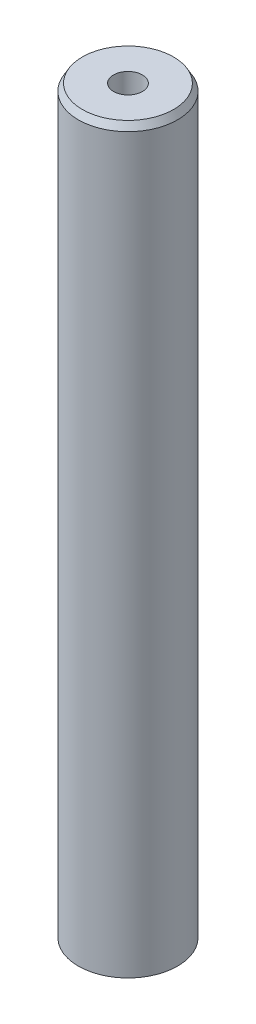
ISO-10303-21;
HEADER;
FILE_DESCRIPTION(('STEP AP214'),'2;1');
FILE_NAME('part.step','',(''),(''),'','','');
FILE_SCHEMA(('AUTOMOTIVE_DESIGN { 1 0 10303 214 1 1 1 1 }'));
ENDSEC;
DATA;
#1=APPLICATION_CONTEXT('core data for automotive mechanical design processes');
#2=APPLICATION_PROTOCOL_DEFINITION('international standard','automotive_design',2000,#1);
#3=PRODUCT_CONTEXT('',#1,'mechanical');
#4=PRODUCT('Part','Part','',(#3));
#5=PRODUCT_RELATED_PRODUCT_CATEGORY('part','',(#4));
#6=PRODUCT_DEFINITION_FORMATION('','',#4);
#7=PRODUCT_DEFINITION_CONTEXT('part definition',#1,'design');
#8=PRODUCT_DEFINITION('design','',#6,#7);
#9=PRODUCT_DEFINITION_SHAPE('','',#8);
#10=(LENGTH_UNIT() NAMED_UNIT(*) SI_UNIT(.MILLI.,.METRE.));
#11=(NAMED_UNIT(*) PLANE_ANGLE_UNIT() SI_UNIT($,.RADIAN.));
#12=(NAMED_UNIT(*) SI_UNIT($,.STERADIAN.) SOLID_ANGLE_UNIT());
#13=UNCERTAINTY_MEASURE_WITH_UNIT(LENGTH_MEASURE(1.E-05),#10,'distance_accuracy_value','');
#14=(GEOMETRIC_REPRESENTATION_CONTEXT(3) GLOBAL_UNCERTAINTY_ASSIGNED_CONTEXT((#13)) GLOBAL_UNIT_ASSIGNED_CONTEXT((#10,
#11,#12)) REPRESENTATION_CONTEXT('',''));
#15=CARTESIAN_POINT('',(0.,0.,0.));
#16=DIRECTION('',(0.,0.,1.));
#17=DIRECTION('',(1.,0.,0.));
#18=AXIS2_PLACEMENT_3D('',#15,#16,#17);
#19=CARTESIAN_POINT('',(0.,600.,0.));
#20=DIRECTION('',(0.,-1.,0.));
#21=DIRECTION('',(0.,0.,-1.));
#22=AXIS2_PLACEMENT_3D('',#19,#20,#21);
#23=CYLINDRICAL_SURFACE('',#22,40.);
#24=CARTESIAN_POINT('',(0.,594.401600889395,0.));
#25=DIRECTION('',(0.,1.,0.));
#26=DIRECTION('',(0.,0.,1.));
#27=AXIS2_PLACEMENT_3D('',#24,#25,#26);
#28=CIRCLE('',#27,40.);
#29=CARTESIAN_POINT('',(0.,594.401600889395,40.));
#30=VERTEX_POINT('',#29);
#31=EDGE_CURVE('E50',#30,#30,#28,.F.);
#32=ORIENTED_EDGE('',*,*,#31,.T.);
#33=EDGE_LOOP('',(#32));
#34=FACE_BOUND('',#33,.T.);
#35=CARTESIAN_POINT('',(0.,3.23223723353905,0.));
#36=DIRECTION('',(0.,1.,0.));
#37=DIRECTION('',(0.,0.,1.));
#38=AXIS2_PLACEMENT_3D('',#35,#36,#37);
#39=CIRCLE('',#38,40.);
#40=CARTESIAN_POINT('',(0.,3.23223723353905,40.));
#41=VERTEX_POINT('',#40);
#42=EDGE_CURVE('E51',#41,#41,#39,.T.);
#43=ORIENTED_EDGE('',*,*,#42,.T.);
#44=EDGE_LOOP('',(#43));
#45=FACE_BOUND('',#44,.T.);
#46=ADVANCED_FACE('F39',(#34,#45),#23,.T.);
#47=CARTESIAN_POINT('',(0.,600.,0.));
#48=DIRECTION('',(0.,1.,0.));
#49=DIRECTION('',(0.,0.,1.));
#50=AXIS2_PLACEMENT_3D('',#47,#48,#49);
#51=PLANE('',#50);
#52=CARTESIAN_POINT('',(0.,600.,0.));
#53=DIRECTION('',(0.,1.,0.));
#54=DIRECTION('',(0.,0.,1.));
#55=AXIS2_PLACEMENT_3D('',#52,#53,#54);
#56=CIRCLE('',#55,36.767762766461);
#57=CARTESIAN_POINT('',(0.,600.,36.767762766461));
#58=VERTEX_POINT('',#57);
#59=EDGE_CURVE('E54',#58,#58,#56,.T.);
#60=ORIENTED_EDGE('',*,*,#59,.T.);
#61=EDGE_LOOP('',(#60));
#62=FACE_BOUND('',#61,.T.);
#63=CARTESIAN_POINT('',(0.,600.,0.));
#64=DIRECTION('',(0.,1.,0.));
#65=DIRECTION('',(0.,0.,1.));
#66=AXIS2_PLACEMENT_3D('',#63,#64,#65);
#67=CIRCLE('',#66,11.6441970601598);
#68=CARTESIAN_POINT('',(0.,600.,11.6441970601598));
#69=VERTEX_POINT('',#68);
#70=EDGE_CURVE('E58',#69,#69,#67,.T.);
#71=ORIENTED_EDGE('',*,*,#70,.F.);
#72=EDGE_LOOP('',(#71));
#73=FACE_BOUND('',#72,.T.);
#74=ADVANCED_FACE('F69',(#62,#73),#51,.T.);
#75=CARTESIAN_POINT('',(0.,0.,0.));
#76=DIRECTION('',(0.,1.,0.));
#77=DIRECTION('',(0.,0.,1.));
#78=AXIS2_PLACEMENT_3D('',#75,#76,#77);
#79=PLANE('',#78);
#80=CARTESIAN_POINT('',(0.,0.,0.));
#81=DIRECTION('',(0.,1.,0.));
#82=DIRECTION('',(0.,0.,1.));
#83=AXIS2_PLACEMENT_3D('',#80,#81,#82);
#84=CIRCLE('',#83,34.4016008893946);
#85=CARTESIAN_POINT('',(0.,0.,34.4016008893946));
#86=VERTEX_POINT('',#85);
#87=EDGE_CURVE('E10',#86,#86,#84,.F.);
#88=ORIENTED_EDGE('',*,*,#87,.T.);
#89=EDGE_LOOP('',(#88));
#90=FACE_BOUND('',#89,.T.);
#91=CARTESIAN_POINT('',(0.,0.,0.));
#92=DIRECTION('',(0.,1.,0.));
#93=DIRECTION('',(0.,0.,1.));
#94=AXIS2_PLACEMENT_3D('',#91,#92,#93);
#95=CIRCLE('',#94,11.6441970601598);
#96=CARTESIAN_POINT('',(0.,0.,11.6441970601598));
#97=VERTEX_POINT('',#96);
#98=EDGE_CURVE('E63',#97,#97,#95,.T.);
#99=ORIENTED_EDGE('',*,*,#98,.T.);
#100=EDGE_LOOP('',(#99));
#101=FACE_BOUND('',#100,.T.);
#102=ADVANCED_FACE('F75',(#90,#101),#79,.F.);
#103=CARTESIAN_POINT('',(0.,600.,0.));
#104=DIRECTION('',(0.,-1.,0.));
#105=DIRECTION('',(0.,0.,-1.));
#106=AXIS2_PLACEMENT_3D('',#103,#104,#105);
#107=CYLINDRICAL_SURFACE('',#106,11.6441970601598);
#108=ORIENTED_EDGE('',*,*,#70,.T.);
#109=EDGE_LOOP('',(#108));
#110=FACE_BOUND('',#109,.T.);
#111=ORIENTED_EDGE('',*,*,#98,.F.);
#112=EDGE_LOOP('',(#111));
#113=FACE_BOUND('',#112,.T.);
#114=ADVANCED_FACE('F70',(#110,#113),#107,.F.);
#115=CARTESIAN_POINT('',(0.,600.,0.));
#116=DIRECTION('',(0.,-1.,0.));
#117=DIRECTION('',(0.,0.,-1.));
#118=AXIS2_PLACEMENT_3D('',#115,#116,#117);
#119=CONICAL_SURFACE('',#118,36.767762766461,0.5235987755983);
#120=ORIENTED_EDGE('',*,*,#31,.F.);
#121=EDGE_LOOP('',(#120));
#122=FACE_BOUND('',#121,.T.);
#123=ORIENTED_EDGE('',*,*,#59,.F.);
#124=EDGE_LOOP('',(#123));
#125=FACE_BOUND('',#124,.T.);
#126=ADVANCED_FACE('F81',(#122,#125),#119,.T.);
#127=CARTESIAN_POINT('',(0.,3.23223723353905,0.));
#128=DIRECTION('',(0.,1.,0.));
#129=DIRECTION('',(0.,0.,1.));
#130=AXIS2_PLACEMENT_3D('',#127,#128,#129);
#131=CONICAL_SURFACE('',#130,40.,1.04719755119659);
#132=ORIENTED_EDGE('',*,*,#87,.F.);
#133=EDGE_LOOP('',(#132));
#134=FACE_BOUND('',#133,.T.);
#135=ORIENTED_EDGE('',*,*,#42,.F.);
#136=EDGE_LOOP('',(#135));
#137=FACE_BOUND('',#136,.T.);
#138=ADVANCED_FACE('F45',(#134,#137),#131,.T.);
#139=CLOSED_SHELL('',(#46,#74,#102,#114,#126,#138));
#140=MANIFOLD_SOLID_BREP('B2',#139);
#141=ADVANCED_BREP_SHAPE_REPRESENTATION('',(#18,#140),#14);
#142=SHAPE_DEFINITION_REPRESENTATION(#9,#141);
ENDSEC;
END-ISO-10303-21;
